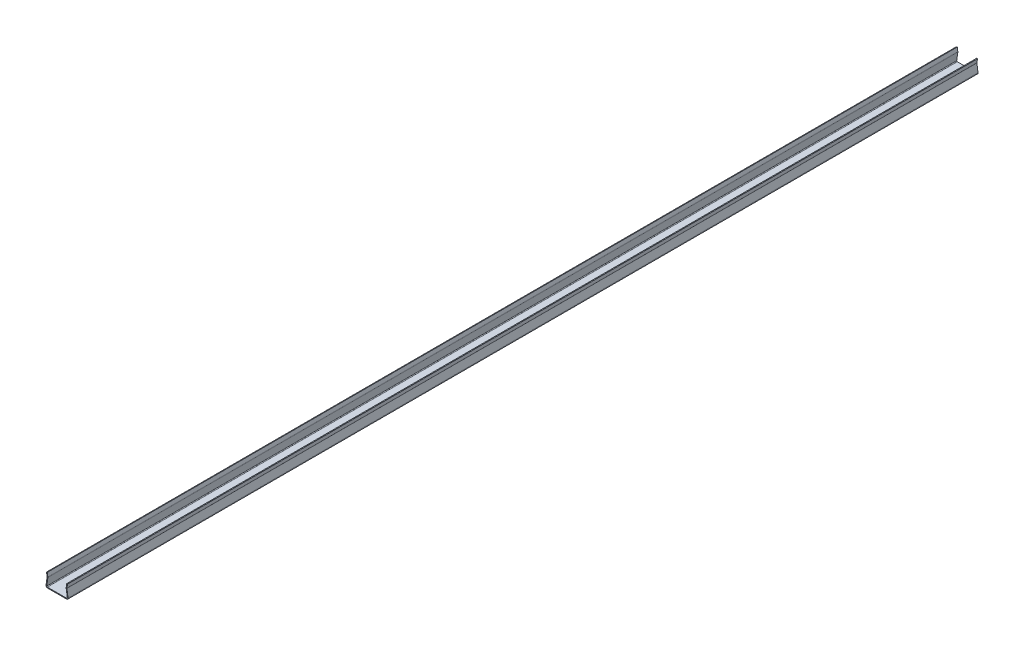
ISO-10303-21;
HEADER;
FILE_DESCRIPTION(('STEP AP214'),'2;1');
FILE_NAME('part.step','',(''),(''),'','','');
FILE_SCHEMA(('AUTOMOTIVE_DESIGN { 1 0 10303 214 1 1 1 1 }'));
ENDSEC;
DATA;
#1=APPLICATION_CONTEXT('core data for automotive mechanical design processes');
#2=APPLICATION_PROTOCOL_DEFINITION('international standard','automotive_design',2000,#1);
#3=PRODUCT_CONTEXT('',#1,'mechanical');
#4=PRODUCT('Part','Part','',(#3));
#5=PRODUCT_RELATED_PRODUCT_CATEGORY('part','',(#4));
#6=PRODUCT_DEFINITION_FORMATION('','',#4);
#7=PRODUCT_DEFINITION_CONTEXT('part definition',#1,'design');
#8=PRODUCT_DEFINITION('design','',#6,#7);
#9=PRODUCT_DEFINITION_SHAPE('','',#8);
#10=(LENGTH_UNIT() NAMED_UNIT(*) SI_UNIT(.MILLI.,.METRE.));
#11=(NAMED_UNIT(*) PLANE_ANGLE_UNIT() SI_UNIT($,.RADIAN.));
#12=(NAMED_UNIT(*) SI_UNIT($,.STERADIAN.) SOLID_ANGLE_UNIT());
#13=UNCERTAINTY_MEASURE_WITH_UNIT(LENGTH_MEASURE(1.E-05),#10,'distance_accuracy_value','');
#14=(GEOMETRIC_REPRESENTATION_CONTEXT(3) GLOBAL_UNCERTAINTY_ASSIGNED_CONTEXT((#13)) GLOBAL_UNIT_ASSIGNED_CONTEXT((#10,
#11,#12)) REPRESENTATION_CONTEXT('',''));
#15=CARTESIAN_POINT('',(0.,0.,0.));
#16=DIRECTION('',(0.,0.,1.));
#17=DIRECTION('',(1.,0.,0.));
#18=AXIS2_PLACEMENT_3D('',#15,#16,#17);
#19=CARTESIAN_POINT('',(-15.0458449843556,14.1676238634243,749.));
#20=DIRECTION('',(0.,0.,1.));
#21=DIRECTION('',(1.,0.,0.));
#22=AXIS2_PLACEMENT_3D('',#19,#20,#21);
#23=PLANE('',#22);
#24=DIRECTION('',(-0.990621129243475,0.136637397137033,0.));
#25=VECTOR('',#24,1.);
#26=CARTESIAN_POINT('',(-15.0458449843556,14.1676238634243,749.));
#27=LINE('',#26,#25);
#28=CARTESIAN_POINT('',(-15.0458449843556,14.1676238634243,749.));
#29=VERTEX_POINT('',#28);
#30=CARTESIAN_POINT('',(-16.333652452372,14.3452524797023,749.));
#31=VERTEX_POINT('',#30);
#32=EDGE_CURVE('E11',#29,#31,#27,.T.);
#33=ORIENTED_EDGE('',*,*,#32,.F.);
#34=CARTESIAN_POINT('',(-17.3242735816156,14.4818898768388,749.));
#35=DIRECTION('',(0.,0.,1.));
#36=DIRECTION('',(1.,0.,0.));
#37=AXIS2_PLACEMENT_3D('',#34,#35,#36);
#38=CIRCLE('',#37,2.3);
#39=CARTESIAN_POINT('',(-15.0510186770191,14.8316214006232,749.));
#40=VERTEX_POINT('',#39);
#41=EDGE_CURVE('E345',#40,#29,#38,.F.);
#42=ORIENTED_EDGE('',*,*,#41,.F.);
#43=DIRECTION('',(0.988371697650617,0.152057184253942,0.));
#44=VECTOR('',#43,1.);
#45=CARTESIAN_POINT('',(-16.3359018839648,14.6339470610934,749.));
#46=LINE('',#45,#44);
#47=CARTESIAN_POINT('',(-16.3359018839648,14.6339470610934,749.));
#48=VERTEX_POINT('',#47);
#49=EDGE_CURVE('E24',#48,#40,#46,.T.);
#50=ORIENTED_EDGE('',*,*,#49,.F.);
#51=CARTESIAN_POINT('',(-17.3242735816156,14.4818898768388,749.));
#52=DIRECTION('',(0.,0.,1.));
#53=DIRECTION('',(1.,0.,0.));
#54=AXIS2_PLACEMENT_3D('',#51,#52,#53);
#55=CIRCLE('',#54,1.);
#56=EDGE_CURVE('E358',#48,#31,#55,.F.);
#57=ORIENTED_EDGE('',*,*,#56,.T.);
#58=EDGE_LOOP('',(#33,#42,#50,#57));
#59=FACE_BOUND('',#58,.T.);
#60=ADVANCED_FACE('F16',(#59),#23,.T.);
#61=CARTESIAN_POINT('',(-16.3359018839648,14.6339470610934,749.));
#62=DIRECTION('',(0.,0.,1.));
#63=DIRECTION('',(1.,0.,0.));
#64=AXIS2_PLACEMENT_3D('',#61,#62,#63);
#65=PLANE('',#64);
#66=DIRECTION('',(-0.136637397137031,-0.990621129243475,0.));
#67=VECTOR('',#66,1.);
#68=CARTESIAN_POINT('',(-17.,0.,749.));
#69=LINE('',#68,#67);
#70=CARTESIAN_POINT('',(-16.8432224279814,1.13663739713754,749.));
#71=VERTEX_POINT('',#70);
#72=EDGE_CURVE('E349',#29,#71,#69,.T.);
#73=ORIENTED_EDGE('',*,*,#72,.F.);
#74=ORIENTED_EDGE('',*,*,#32,.T.);
#75=DIRECTION('',(-0.136637397137031,-0.990621129243475,0.));
#76=VECTOR('',#75,1.);
#77=CARTESIAN_POINT('',(-18.2878074680168,0.177628616278236,749.));
#78=LINE('',#77,#76);
#79=CARTESIAN_POINT('',(-18.1310298959977,1.314266013416,749.));
#80=VERTEX_POINT('',#79);
#81=EDGE_CURVE('E360',#31,#80,#78,.T.);
#82=ORIENTED_EDGE('',*,*,#81,.T.);
#83=DIRECTION('',(0.990621129243475,-0.136637397137031,0.));
#84=VECTOR('',#83,1.);
#85=CARTESIAN_POINT('',(-18.1310298959977,1.314266013416,749.));
#86=LINE('',#85,#84);
#87=EDGE_CURVE('E319',#80,#71,#86,.T.);
#88=ORIENTED_EDGE('',*,*,#87,.T.);
#89=EDGE_LOOP('',(#73,#74,#82,#88));
#90=FACE_BOUND('',#89,.T.);
#91=ADVANCED_FACE('F429',(#90),#65,.T.);
#92=CARTESIAN_POINT('',(-15.051018677019,14.8316214006232,-749.));
#93=DIRECTION('',(0.,0.,-1.));
#94=DIRECTION('',(-1.,0.,0.));
#95=AXIS2_PLACEMENT_3D('',#92,#93,#94);
#96=PLANE('',#95);
#97=DIRECTION('',(-0.988371697650617,-0.152057184253942,0.));
#98=VECTOR('',#97,1.);
#99=CARTESIAN_POINT('',(-15.051018677019,14.8316214006232,-749.));
#100=LINE('',#99,#98);
#101=CARTESIAN_POINT('',(-15.051018677019,14.8316214006232,-749.));
#102=VERTEX_POINT('',#101);
#103=CARTESIAN_POINT('',(-16.3359018839649,14.6339470610937,-749.));
#104=VERTEX_POINT('',#103);
#105=EDGE_CURVE('E325',#102,#104,#100,.T.);
#106=ORIENTED_EDGE('',*,*,#105,.F.);
#107=CARTESIAN_POINT('',(-17.3242735816156,14.4818898768391,-749.));
#108=DIRECTION('',(0.,0.,1.));
#109=DIRECTION('',(1.,0.,0.));
#110=AXIS2_PLACEMENT_3D('',#107,#108,#109);
#111=CIRCLE('',#110,2.3);
#112=CARTESIAN_POINT('',(-15.0458449843554,14.1676238634238,-749.));
#113=VERTEX_POINT('',#112);
#114=EDGE_CURVE('E229',#102,#113,#111,.F.);
#115=ORIENTED_EDGE('',*,*,#114,.T.);
#116=DIRECTION('',(0.990621129243475,-0.136637397137033,0.));
#117=VECTOR('',#116,1.);
#118=CARTESIAN_POINT('',(-16.333652452372,14.3452524797019,-749.));
#119=LINE('',#118,#117);
#120=CARTESIAN_POINT('',(-16.333652452372,14.3452524797019,-749.));
#121=VERTEX_POINT('',#120);
#122=EDGE_CURVE('E323',#121,#113,#119,.T.);
#123=ORIENTED_EDGE('',*,*,#122,.F.);
#124=CARTESIAN_POINT('',(-17.3242735816156,14.4818898768391,-749.));
#125=DIRECTION('',(0.,0.,1.));
#126=DIRECTION('',(1.,0.,0.));
#127=AXIS2_PLACEMENT_3D('',#124,#125,#126);
#128=CIRCLE('',#127,1.);
#129=EDGE_CURVE('E241',#104,#121,#128,.F.);
#130=ORIENTED_EDGE('',*,*,#129,.F.);
#131=EDGE_LOOP('',(#106,#115,#123,#130));
#132=FACE_BOUND('',#131,.T.);
#133=ADVANCED_FACE('F474',(#132),#96,.T.);
#134=CARTESIAN_POINT('',(-16.333652452372,14.3452524797019,-749.));
#135=DIRECTION('',(0.,0.,-1.));
#136=DIRECTION('',(-1.,0.,0.));
#137=AXIS2_PLACEMENT_3D('',#134,#135,#136);
#138=PLANE('',#137);
#139=DIRECTION('',(0.152057184253941,-0.988371697650617,0.));
#140=VECTOR('',#139,1.);
#141=CARTESIAN_POINT('',(-15.0000000000002,14.5,-749.));
#142=LINE('',#141,#140);
#143=CARTESIAN_POINT('',(-16.,21.0000000000004,-749.));
#144=VERTEX_POINT('',#143);
#145=EDGE_CURVE('E232',#144,#102,#142,.T.);
#146=ORIENTED_EDGE('',*,*,#145,.T.);
#147=ORIENTED_EDGE('',*,*,#105,.T.);
#148=DIRECTION('',(0.152057184253941,-0.988371697650617,0.));
#149=VECTOR('',#148,1.);
#150=CARTESIAN_POINT('',(-16.2848832069458,14.30232566047,-749.));
#151=LINE('',#150,#149);
#152=CARTESIAN_POINT('',(-17.2848832069461,20.8023256604699,-749.));
#153=VERTEX_POINT('',#152);
#154=EDGE_CURVE('E238',#153,#104,#151,.T.);
#155=ORIENTED_EDGE('',*,*,#154,.F.);
#156=DIRECTION('',(0.988371697650617,0.152057184253942,0.));
#157=VECTOR('',#156,1.);
#158=CARTESIAN_POINT('',(-17.2848832069461,20.8023256604699,-749.));
#159=LINE('',#158,#157);
#160=EDGE_CURVE('E235',#153,#144,#159,.T.);
#161=ORIENTED_EDGE('',*,*,#160,.T.);
#162=EDGE_LOOP('',(#146,#147,#155,#161));
#163=FACE_BOUND('',#162,.T.);
#164=ADVANCED_FACE('F479',(#163),#138,.T.);
#165=CARTESIAN_POINT('',(-15.8526012987378,8.88178419700125E-13,749.));
#166=DIRECTION('',(0.,0.,1.));
#167=DIRECTION('',(1.,0.,0.));
#168=AXIS2_PLACEMENT_3D('',#165,#166,#167);
#169=PLANE('',#168);
#170=DIRECTION('',(0.,-1.,0.));
#171=VECTOR('',#170,1.);
#172=CARTESIAN_POINT('',(-15.8526012987378,8.88178419700125E-13,749.));
#173=LINE('',#172,#171);
#174=CARTESIAN_POINT('',(-15.8526012987378,8.88178419700125E-13,749.));
#175=VERTEX_POINT('',#174);
#176=CARTESIAN_POINT('',(-15.8526012987378,-1.29999999999919,749.));
#177=VERTEX_POINT('',#176);
#178=EDGE_CURVE('E321',#175,#177,#173,.T.);
#179=ORIENTED_EDGE('',*,*,#178,.F.);
#180=CARTESIAN_POINT('',(-15.8526012987377,0.99999999999989,749.));
#181=DIRECTION('',(0.,0.,-1.));
#182=DIRECTION('',(-1.,0.,0.));
#183=AXIS2_PLACEMENT_3D('',#180,#181,#182);
#184=CIRCLE('',#183,1.);
#185=EDGE_CURVE('E419',#71,#175,#184,.F.);
#186=ORIENTED_EDGE('',*,*,#185,.F.);
#187=ORIENTED_EDGE('',*,*,#87,.F.);
#188=CARTESIAN_POINT('',(-15.8526012987377,0.99999999999989,749.));
#189=DIRECTION('',(0.,0.,1.));
#190=DIRECTION('',(1.,0.,0.));
#191=AXIS2_PLACEMENT_3D('',#188,#189,#190);
#192=CIRCLE('',#191,2.3);
#193=EDGE_CURVE('E363',#80,#177,#192,.T.);
#194=ORIENTED_EDGE('',*,*,#193,.T.);
#195=EDGE_LOOP('',(#179,#186,#187,#194));
#196=FACE_BOUND('',#195,.T.);
#197=ADVANCED_FACE('F436',(#196),#169,.T.);
#198=CARTESIAN_POINT('',(-18.1310298959977,1.314266013416,749.));
#199=DIRECTION('',(0.,0.,1.));
#200=DIRECTION('',(1.,0.,0.));
#201=AXIS2_PLACEMENT_3D('',#198,#199,#200);
#202=PLANE('',#201);
#203=DIRECTION('',(1.,0.,0.));
#204=VECTOR('',#203,1.);
#205=CARTESIAN_POINT('',(-17.,0.,749.));
#206=LINE('',#205,#204);
#207=CARTESIAN_POINT('',(15.8526012987377,0.,749.));
#208=VERTEX_POINT('',#207);
#209=EDGE_CURVE('E416',#175,#208,#206,.T.);
#210=ORIENTED_EDGE('',*,*,#209,.F.);
#211=ORIENTED_EDGE('',*,*,#178,.T.);
#212=DIRECTION('',(1.,0.,0.));
#213=VECTOR('',#212,1.);
#214=CARTESIAN_POINT('',(-17.,-1.29999999999919,749.));
#215=LINE('',#214,#213);
#216=CARTESIAN_POINT('',(15.8526012987376,-1.29999999999986,749.));
#217=VERTEX_POINT('',#216);
#218=EDGE_CURVE('E183',#177,#217,#215,.T.);
#219=ORIENTED_EDGE('',*,*,#218,.T.);
#220=DIRECTION('',(0.,1.,0.));
#221=VECTOR('',#220,1.);
#222=CARTESIAN_POINT('',(15.8526012987376,-1.29999999999986,749.));
#223=LINE('',#222,#221);
#224=EDGE_CURVE('E174',#217,#208,#223,.T.);
#225=ORIENTED_EDGE('',*,*,#224,.T.);
#226=EDGE_LOOP('',(#210,#211,#219,#225));
#227=FACE_BOUND('',#226,.T.);
#228=ADVANCED_FACE('F369',(#227),#202,.T.);
#229=CARTESIAN_POINT('',(-16.8432224279812,1.13663739713687,-749.));
#230=DIRECTION('',(0.,0.,-1.));
#231=DIRECTION('',(-1.,0.,0.));
#232=AXIS2_PLACEMENT_3D('',#229,#230,#231);
#233=PLANE('',#232);
#234=DIRECTION('',(-0.990621129243475,0.136637397137031,0.));
#235=VECTOR('',#234,1.);
#236=CARTESIAN_POINT('',(-16.8432224279812,1.13663739713687,-749.));
#237=LINE('',#236,#235);
#238=CARTESIAN_POINT('',(-16.8432224279812,1.13663739713687,-749.));
#239=VERTEX_POINT('',#238);
#240=CARTESIAN_POINT('',(-18.1310298959979,1.31426601341533,-749.));
#241=VERTEX_POINT('',#240);
#242=EDGE_CURVE('E317',#239,#241,#237,.T.);
#243=ORIENTED_EDGE('',*,*,#242,.F.);
#244=CARTESIAN_POINT('',(-15.8526012987377,1.00000000000011,-749.));
#245=DIRECTION('',(0.,0.,-1.));
#246=DIRECTION('',(-1.,0.,0.));
#247=AXIS2_PLACEMENT_3D('',#244,#245,#246);
#248=CIRCLE('',#247,1.);
#249=CARTESIAN_POINT('',(-15.8526012987376,4.44089209850063E-13,-749.));
#250=VERTEX_POINT('',#249);
#251=EDGE_CURVE('E223',#239,#250,#248,.F.);
#252=ORIENTED_EDGE('',*,*,#251,.T.);
#253=DIRECTION('',(0.,1.,0.));
#254=VECTOR('',#253,1.);
#255=CARTESIAN_POINT('',(-15.8526012987376,-1.29999999999919,-749.));
#256=LINE('',#255,#254);
#257=CARTESIAN_POINT('',(-15.8526012987376,-1.29999999999919,-749.));
#258=VERTEX_POINT('',#257);
#259=EDGE_CURVE('E173',#258,#250,#256,.T.);
#260=ORIENTED_EDGE('',*,*,#259,.F.);
#261=CARTESIAN_POINT('',(-15.8526012987377,1.00000000000011,-749.));
#262=DIRECTION('',(0.,0.,1.));
#263=DIRECTION('',(1.,0.,0.));
#264=AXIS2_PLACEMENT_3D('',#261,#262,#263);
#265=CIRCLE('',#264,2.3);
#266=EDGE_CURVE('E247',#241,#258,#265,.T.);
#267=ORIENTED_EDGE('',*,*,#266,.F.);
#268=EDGE_LOOP('',(#243,#252,#260,#267));
#269=FACE_BOUND('',#268,.T.);
#270=ADVANCED_FACE('F445',(#269),#233,.T.);
#271=CARTESIAN_POINT('',(-15.8526012987376,-1.29999999999919,-749.));
#272=DIRECTION('',(0.,0.,-1.));
#273=DIRECTION('',(-1.,0.,0.));
#274=AXIS2_PLACEMENT_3D('',#271,#272,#273);
#275=PLANE('',#274);
#276=DIRECTION('',(-0.136637397137031,-0.990621129243475,0.));
#277=VECTOR('',#276,1.);
#278=CARTESIAN_POINT('',(-17.,8.88178419700125E-13,-749.));
#279=LINE('',#278,#277);
#280=EDGE_CURVE('E226',#113,#239,#279,.T.);
#281=ORIENTED_EDGE('',*,*,#280,.T.);
#282=ORIENTED_EDGE('',*,*,#242,.T.);
#283=DIRECTION('',(-0.136637397137031,-0.990621129243475,0.));
#284=VECTOR('',#283,1.);
#285=CARTESIAN_POINT('',(-18.2878074680169,0.177628616278236,-749.));
#286=LINE('',#285,#284);
#287=EDGE_CURVE('E244',#121,#241,#286,.T.);
#288=ORIENTED_EDGE('',*,*,#287,.F.);
#289=ORIENTED_EDGE('',*,*,#122,.T.);
#290=EDGE_LOOP('',(#281,#282,#288,#289));
#291=FACE_BOUND('',#290,.T.);
#292=ADVANCED_FACE('F449',(#291),#275,.T.);
#293=CARTESIAN_POINT('',(16.8432224279812,1.13663739713776,749.));
#294=DIRECTION('',(0.,0.,1.));
#295=DIRECTION('',(1.,0.,0.));
#296=AXIS2_PLACEMENT_3D('',#293,#294,#295);
#297=PLANE('',#296);
#298=DIRECTION('',(0.990621129243475,0.136637397137031,0.));
#299=VECTOR('',#298,1.);
#300=CARTESIAN_POINT('',(16.8432224279812,1.13663739713776,749.));
#301=LINE('',#300,#299);
#302=CARTESIAN_POINT('',(16.8432224279812,1.13663739713776,749.));
#303=VERTEX_POINT('',#302);
#304=CARTESIAN_POINT('',(18.1310298959975,1.314266013416,749.));
#305=VERTEX_POINT('',#304);
#306=EDGE_CURVE('E161',#303,#305,#301,.T.);
#307=ORIENTED_EDGE('',*,*,#306,.F.);
#308=CARTESIAN_POINT('',(15.8526012987376,1.00000000000033,749.));
#309=DIRECTION('',(0.,0.,-1.));
#310=DIRECTION('',(-1.,0.,0.));
#311=AXIS2_PLACEMENT_3D('',#308,#309,#310);
#312=CIRCLE('',#311,1.);
#313=EDGE_CURVE('E381',#208,#303,#312,.F.);
#314=ORIENTED_EDGE('',*,*,#313,.F.);
#315=ORIENTED_EDGE('',*,*,#224,.F.);
#316=CARTESIAN_POINT('',(15.8526012987376,1.00000000000033,749.));
#317=DIRECTION('',(0.,0.,1.));
#318=DIRECTION('',(1.,0.,0.));
#319=AXIS2_PLACEMENT_3D('',#316,#317,#318);
#320=CIRCLE('',#319,2.3);
#321=EDGE_CURVE('E177',#217,#305,#320,.T.);
#322=ORIENTED_EDGE('',*,*,#321,.T.);
#323=EDGE_LOOP('',(#307,#314,#315,#322));
#324=FACE_BOUND('',#323,.T.);
#325=ADVANCED_FACE('F179',(#324),#297,.T.);
#326=CARTESIAN_POINT('',(15.8526012987376,-1.29999999999986,749.));
#327=DIRECTION('',(0.,0.,1.));
#328=DIRECTION('',(1.,0.,0.));
#329=AXIS2_PLACEMENT_3D('',#326,#327,#328);
#330=PLANE('',#329);
#331=DIRECTION('',(-0.136637397137031,0.990621129243475,0.));
#332=VECTOR('',#331,1.);
#333=CARTESIAN_POINT('',(17.,0.,749.));
#334=LINE('',#333,#332);
#335=CARTESIAN_POINT('',(15.0458449843551,14.1676238634243,749.));
#336=VERTEX_POINT('',#335);
#337=EDGE_CURVE('E168',#303,#336,#334,.T.);
#338=ORIENTED_EDGE('',*,*,#337,.F.);
#339=ORIENTED_EDGE('',*,*,#306,.T.);
#340=DIRECTION('',(-0.136637397137031,0.990621129243475,0.));
#341=VECTOR('',#340,1.);
#342=CARTESIAN_POINT('',(18.2878074680165,0.17762861627868,749.));
#343=LINE('',#342,#341);
#344=CARTESIAN_POINT('',(16.3336524523718,14.3452524797025,749.));
#345=VERTEX_POINT('',#344);
#346=EDGE_CURVE('E165',#305,#345,#343,.T.);
#347=ORIENTED_EDGE('',*,*,#346,.T.);
#348=DIRECTION('',(-0.990621129243474,-0.136637397137034,0.));
#349=VECTOR('',#348,1.);
#350=CARTESIAN_POINT('',(16.3336524523718,14.3452524797025,749.));
#351=LINE('',#350,#349);
#352=EDGE_CURVE('E308',#345,#336,#351,.T.);
#353=ORIENTED_EDGE('',*,*,#352,.T.);
#354=EDGE_LOOP('',(#338,#339,#347,#353));
#355=FACE_BOUND('',#354,.T.);
#356=ADVANCED_FACE('F163',(#355),#330,.T.);
#357=CARTESIAN_POINT('',(15.8526012987376,8.88178419700125E-13,-749.));
#358=DIRECTION('',(0.,0.,-1.));
#359=DIRECTION('',(-1.,0.,0.));
#360=AXIS2_PLACEMENT_3D('',#357,#358,#359);
#361=PLANE('',#360);
#362=DIRECTION('',(0.,-1.,0.));
#363=VECTOR('',#362,1.);
#364=CARTESIAN_POINT('',(15.8526012987376,8.88178419700125E-13,-749.));
#365=LINE('',#364,#363);
#366=CARTESIAN_POINT('',(15.8526012987376,8.88178419700125E-13,-749.));
#367=VERTEX_POINT('',#366);
#368=CARTESIAN_POINT('',(15.8526012987375,-1.29999999999986,-749.));
#369=VERTEX_POINT('',#368);
#370=EDGE_CURVE('E313',#367,#369,#365,.T.);
#371=ORIENTED_EDGE('',*,*,#370,.F.);
#372=CARTESIAN_POINT('',(15.8526012987375,1.00000000000078,-749.));
#373=DIRECTION('',(0.,0.,-1.));
#374=DIRECTION('',(-1.,0.,0.));
#375=AXIS2_PLACEMENT_3D('',#372,#373,#374);
#376=CIRCLE('',#375,1.);
#377=CARTESIAN_POINT('',(16.843222427981,1.1366373971371,-749.));
#378=VERTEX_POINT('',#377);
#379=EDGE_CURVE('E217',#367,#378,#376,.F.);
#380=ORIENTED_EDGE('',*,*,#379,.T.);
#381=DIRECTION('',(-0.990621129243475,-0.136637397137031,0.));
#382=VECTOR('',#381,1.);
#383=CARTESIAN_POINT('',(18.1310298959975,1.31426601341511,-749.));
#384=LINE('',#383,#382);
#385=CARTESIAN_POINT('',(18.1310298959975,1.31426601341511,-749.));
#386=VERTEX_POINT('',#385);
#387=EDGE_CURVE('E311',#386,#378,#384,.T.);
#388=ORIENTED_EDGE('',*,*,#387,.F.);
#389=CARTESIAN_POINT('',(15.8526012987375,1.00000000000078,-749.));
#390=DIRECTION('',(0.,0.,1.));
#391=DIRECTION('',(1.,0.,0.));
#392=AXIS2_PLACEMENT_3D('',#389,#390,#391);
#393=CIRCLE('',#392,2.3);
#394=EDGE_CURVE('E190',#369,#386,#393,.T.);
#395=ORIENTED_EDGE('',*,*,#394,.F.);
#396=EDGE_LOOP('',(#371,#380,#388,#395));
#397=FACE_BOUND('',#396,.T.);
#398=ADVANCED_FACE('F375',(#397),#361,.T.);
#399=CARTESIAN_POINT('',(18.1310298959975,1.31426601341511,-749.));
#400=DIRECTION('',(0.,0.,-1.));
#401=DIRECTION('',(-1.,0.,0.));
#402=AXIS2_PLACEMENT_3D('',#399,#400,#401);
#403=PLANE('',#402);
#404=DIRECTION('',(1.,0.,0.));
#405=VECTOR('',#404,1.);
#406=CARTESIAN_POINT('',(-17.,8.88178419700125E-13,-749.));
#407=LINE('',#406,#405);
#408=EDGE_CURVE('E220',#250,#367,#407,.T.);
#409=ORIENTED_EDGE('',*,*,#408,.T.);
#410=ORIENTED_EDGE('',*,*,#370,.T.);
#411=DIRECTION('',(1.,0.,0.));
#412=VECTOR('',#411,1.);
#413=CARTESIAN_POINT('',(-17.0000000000003,-1.29999999999986,-749.));
#414=LINE('',#413,#412);
#415=EDGE_CURVE('E250',#258,#369,#414,.T.);
#416=ORIENTED_EDGE('',*,*,#415,.F.);
#417=ORIENTED_EDGE('',*,*,#259,.T.);
#418=EDGE_LOOP('',(#409,#410,#416,#417));
#419=FACE_BOUND('',#418,.T.);
#420=ADVANCED_FACE('F455',(#419),#403,.T.);
#421=CARTESIAN_POINT('',(15.0510186770189,14.831621400623,749.));
#422=DIRECTION('',(0.,0.,1.));
#423=DIRECTION('',(1.,0.,0.));
#424=AXIS2_PLACEMENT_3D('',#421,#422,#423);
#425=PLANE('',#424);
#426=DIRECTION('',(0.988371697650617,-0.152057184253941,0.));
#427=VECTOR('',#426,1.);
#428=CARTESIAN_POINT('',(15.0510186770189,14.831621400623,749.));
#429=LINE('',#428,#427);
#430=CARTESIAN_POINT('',(15.0510186770189,14.831621400623,749.));
#431=VERTEX_POINT('',#430);
#432=CARTESIAN_POINT('',(16.3359018839647,14.6339470610928,749.));
#433=VERTEX_POINT('',#432);
#434=EDGE_CURVE('E32',#431,#433,#429,.T.);
#435=ORIENTED_EDGE('',*,*,#434,.F.);
#436=CARTESIAN_POINT('',(17.3242735816154,14.4818898768397,749.));
#437=DIRECTION('',(0.,0.,1.));
#438=DIRECTION('',(1.,0.,0.));
#439=AXIS2_PLACEMENT_3D('',#436,#437,#438);
#440=CIRCLE('',#439,2.3);
#441=EDGE_CURVE('E409',#336,#431,#440,.F.);
#442=ORIENTED_EDGE('',*,*,#441,.F.);
#443=ORIENTED_EDGE('',*,*,#352,.F.);
#444=CARTESIAN_POINT('',(17.3242735816154,14.4818898768397,749.));
#445=DIRECTION('',(0.,0.,1.));
#446=DIRECTION('',(1.,0.,0.));
#447=AXIS2_PLACEMENT_3D('',#444,#445,#446);
#448=CIRCLE('',#447,1.);
#449=EDGE_CURVE('E198',#345,#433,#448,.F.);
#450=ORIENTED_EDGE('',*,*,#449,.T.);
#451=EDGE_LOOP('',(#435,#442,#443,#450));
#452=FACE_BOUND('',#451,.T.);
#453=ADVANCED_FACE('F457',(#452),#425,.T.);
#454=CARTESIAN_POINT('',(16.3336524523718,14.3452524797025,749.));
#455=DIRECTION('',(0.,0.,1.));
#456=DIRECTION('',(1.,0.,0.));
#457=AXIS2_PLACEMENT_3D('',#454,#455,#456);
#458=PLANE('',#457);
#459=DIRECTION('',(0.152057184253941,0.988371697650618,0.));
#460=VECTOR('',#459,1.);
#461=CARTESIAN_POINT('',(15.,14.5000000000008,749.));
#462=LINE('',#461,#460);
#463=CARTESIAN_POINT('',(16.,21.,749.));
#464=VERTEX_POINT('',#463);
#465=EDGE_CURVE('E407',#431,#464,#462,.T.);
#466=ORIENTED_EDGE('',*,*,#465,.F.);
#467=ORIENTED_EDGE('',*,*,#434,.T.);
#468=DIRECTION('',(0.152057184253941,0.988371697650618,0.));
#469=VECTOR('',#468,1.);
#470=CARTESIAN_POINT('',(16.2848832069458,14.3023256604706,749.));
#471=LINE('',#470,#469);
#472=CARTESIAN_POINT('',(17.2848832069459,20.8023256604708,749.));
#473=VERTEX_POINT('',#472);
#474=EDGE_CURVE('E110',#433,#473,#471,.T.);
#475=ORIENTED_EDGE('',*,*,#474,.T.);
#476=DIRECTION('',(0.988371697650617,-0.152057184253942,0.));
#477=VECTOR('',#476,1.);
#478=CARTESIAN_POINT('',(16.,21.,749.));
#479=LINE('',#478,#477);
#480=EDGE_CURVE('E405',#464,#473,#479,.T.);
#481=ORIENTED_EDGE('',*,*,#480,.F.);
#482=EDGE_LOOP('',(#466,#467,#475,#481));
#483=FACE_BOUND('',#482,.T.);
#484=ADVANCED_FACE('F465',(#483),#458,.T.);
#485=CARTESIAN_POINT('',(15.0458449843552,14.1676238634236,-749.));
#486=DIRECTION('',(0.,0.,-1.));
#487=DIRECTION('',(-1.,0.,0.));
#488=AXIS2_PLACEMENT_3D('',#485,#486,#487);
#489=PLANE('',#488);
#490=DIRECTION('',(0.990621129243474,0.136637397137034,0.));
#491=VECTOR('',#490,1.);
#492=CARTESIAN_POINT('',(15.0458449843552,14.1676238634236,-749.));
#493=LINE('',#492,#491);
#494=CARTESIAN_POINT('',(15.0458449843552,14.1676238634236,-749.));
#495=VERTEX_POINT('',#494);
#496=CARTESIAN_POINT('',(16.3336524523716,14.3452524797019,-749.));
#497=VERTEX_POINT('',#496);
#498=EDGE_CURVE('E97',#495,#497,#493,.T.);
#499=ORIENTED_EDGE('',*,*,#498,.F.);
#500=CARTESIAN_POINT('',(17.3242735816151,14.4818898768388,-749.));
#501=DIRECTION('',(0.,0.,1.));
#502=DIRECTION('',(1.,0.,0.));
#503=AXIS2_PLACEMENT_3D('',#500,#501,#502);
#504=CIRCLE('',#503,2.3);
#505=CARTESIAN_POINT('',(15.0510186770189,14.8316214006234,-749.));
#506=VERTEX_POINT('',#505);
#507=EDGE_CURVE('E213',#495,#506,#504,.F.);
#508=ORIENTED_EDGE('',*,*,#507,.T.);
#509=DIRECTION('',(-0.988371697650617,0.152057184253941,0.));
#510=VECTOR('',#509,1.);
#511=CARTESIAN_POINT('',(16.3359018839644,14.633947061093,-749.));
#512=LINE('',#511,#510);
#513=CARTESIAN_POINT('',(16.3359018839644,14.633947061093,-749.));
#514=VERTEX_POINT('',#513);
#515=EDGE_CURVE('E104',#514,#506,#512,.T.);
#516=ORIENTED_EDGE('',*,*,#515,.F.);
#517=CARTESIAN_POINT('',(17.3242735816151,14.4818898768388,-749.));
#518=DIRECTION('',(0.,0.,1.));
#519=DIRECTION('',(1.,0.,0.));
#520=AXIS2_PLACEMENT_3D('',#517,#518,#519);
#521=CIRCLE('',#520,1.);
#522=EDGE_CURVE('E256',#497,#514,#521,.F.);
#523=ORIENTED_EDGE('',*,*,#522,.F.);
#524=EDGE_LOOP('',(#499,#508,#516,#523));
#525=FACE_BOUND('',#524,.T.);
#526=ADVANCED_FACE('F392',(#525),#489,.T.);
#527=CARTESIAN_POINT('',(16.3359018839644,14.633947061093,-749.));
#528=DIRECTION('',(0.,0.,-1.));
#529=DIRECTION('',(-1.,0.,0.));
#530=AXIS2_PLACEMENT_3D('',#527,#528,#529);
#531=PLANE('',#530);
#532=DIRECTION('',(-0.136637397137031,0.990621129243475,0.));
#533=VECTOR('',#532,1.);
#534=CARTESIAN_POINT('',(17.,2.22044604925032E-13,-749.));
#535=LINE('',#534,#533);
#536=EDGE_CURVE('E215',#378,#495,#535,.T.);
#537=ORIENTED_EDGE('',*,*,#536,.T.);
#538=ORIENTED_EDGE('',*,*,#498,.T.);
#539=DIRECTION('',(-0.136637397137031,0.990621129243475,0.));
#540=VECTOR('',#539,1.);
#541=CARTESIAN_POINT('',(18.2878074680164,0.177628616278236,-749.));
#542=LINE('',#541,#540);
#543=EDGE_CURVE('E254',#386,#497,#542,.T.);
#544=ORIENTED_EDGE('',*,*,#543,.F.);
#545=ORIENTED_EDGE('',*,*,#387,.T.);
#546=EDGE_LOOP('',(#537,#538,#544,#545));
#547=FACE_BOUND('',#546,.T.);
#548=ADVANCED_FACE('F377',(#547),#531,.T.);
#549=CARTESIAN_POINT('',(16.2848832069458,14.3023256604706,749.));
#550=DIRECTION('',(-0.988371697650617,0.152057184253941,0.));
#551=DIRECTION('',(-0.152057184253941,-0.988371697650618,0.));
#552=AXIS2_PLACEMENT_3D('',#549,#550,#551);
#553=PLANE('',#552);
#554=DIRECTION('',(0.152057184253941,0.988371697650618,0.));
#555=VECTOR('',#554,1.);
#556=CARTESIAN_POINT('',(16.2848832069457,14.30232566047,-749.));
#557=LINE('',#556,#555);
#558=CARTESIAN_POINT('',(17.284883206946,20.8023256604703,-749.));
#559=VERTEX_POINT('',#558);
#560=EDGE_CURVE('E204',#514,#559,#557,.T.);
#561=ORIENTED_EDGE('',*,*,#560,.T.);
#562=DIRECTION('',(0.,0.,-1.));
#563=VECTOR('',#562,1.);
#564=CARTESIAN_POINT('',(17.2848832069459,20.8023256604708,749.));
#565=LINE('',#564,#563);
#566=EDGE_CURVE('E304',#473,#559,#565,.T.);
#567=ORIENTED_EDGE('',*,*,#566,.F.);
#568=ORIENTED_EDGE('',*,*,#474,.F.);
#569=DIRECTION('',(0.,0.,-1.));
#570=VECTOR('',#569,1.);
#571=CARTESIAN_POINT('',(16.3359018839647,14.6339470610928,749.));
#572=LINE('',#571,#570);
#573=EDGE_CURVE('E200',#433,#514,#572,.T.);
#574=ORIENTED_EDGE('',*,*,#573,.T.);
#575=EDGE_LOOP('',(#561,#567,#568,#574));
#576=FACE_BOUND('',#575,.T.);
#577=ADVANCED_FACE('F398',(#576),#553,.F.);
#578=CARTESIAN_POINT('',(16.,21.,749.));
#579=DIRECTION('',(0.152057184253942,0.988371697650618,0.));
#580=DIRECTION('',(-0.988371697650617,0.152057184253942,0.));
#581=AXIS2_PLACEMENT_3D('',#578,#579,#580);
#582=PLANE('',#581);
#583=DIRECTION('',(0.988371697650617,-0.152057184253942,0.));
#584=VECTOR('',#583,1.);
#585=CARTESIAN_POINT('',(16.,21.,-749.));
#586=LINE('',#585,#584);
#587=CARTESIAN_POINT('',(16.,21.,-749.));
#588=VERTEX_POINT('',#587);
#589=EDGE_CURVE('E207',#588,#559,#586,.T.);
#590=ORIENTED_EDGE('',*,*,#589,.F.);
#591=DIRECTION('',(0.,0.,-1.));
#592=VECTOR('',#591,1.);
#593=CARTESIAN_POINT('',(16.,21.,749.));
#594=LINE('',#593,#592);
#595=EDGE_CURVE('E302',#464,#588,#594,.T.);
#596=ORIENTED_EDGE('',*,*,#595,.F.);
#597=ORIENTED_EDGE('',*,*,#480,.T.);
#598=ORIENTED_EDGE('',*,*,#566,.T.);
#599=EDGE_LOOP('',(#590,#596,#597,#598));
#600=FACE_BOUND('',#599,.T.);
#601=ADVANCED_FACE('F403',(#600),#582,.T.);
#602=CARTESIAN_POINT('',(15.,14.5000000000008,749.));
#603=DIRECTION('',(-0.988371697650617,0.152057184253941,0.));
#604=DIRECTION('',(-0.152057184253941,-0.988371697650618,0.));
#605=AXIS2_PLACEMENT_3D('',#602,#603,#604);
#606=PLANE('',#605);
#607=DIRECTION('',(0.152057184253941,0.988371697650618,0.));
#608=VECTOR('',#607,1.);
#609=CARTESIAN_POINT('',(14.9999999999998,14.5000000000002,-749.));
#610=LINE('',#609,#608);
#611=EDGE_CURVE('E210',#506,#588,#610,.T.);
#612=ORIENTED_EDGE('',*,*,#611,.F.);
#613=DIRECTION('',(0.,0.,-1.));
#614=VECTOR('',#613,1.);
#615=CARTESIAN_POINT('',(15.0510186770189,14.831621400623,749.));
#616=LINE('',#615,#614);
#617=EDGE_CURVE('E299',#431,#506,#616,.T.);
#618=ORIENTED_EDGE('',*,*,#617,.F.);
#619=ORIENTED_EDGE('',*,*,#465,.T.);
#620=ORIENTED_EDGE('',*,*,#595,.T.);
#621=EDGE_LOOP('',(#612,#618,#619,#620));
#622=FACE_BOUND('',#621,.T.);
#623=ADVANCED_FACE('F606',(#622),#606,.T.);
#624=CARTESIAN_POINT('',(17.3242735816154,14.4818898768397,749.));
#625=DIRECTION('',(0.,0.,-1.));
#626=DIRECTION('',(-1.,0.,0.));
#627=AXIS2_PLACEMENT_3D('',#624,#625,#626);
#628=CYLINDRICAL_SURFACE('',#627,2.3);
#629=ORIENTED_EDGE('',*,*,#507,.F.);
#630=DIRECTION('',(0.,0.,-1.));
#631=VECTOR('',#630,1.);
#632=CARTESIAN_POINT('',(15.0458449843551,14.1676238634243,749.));
#633=LINE('',#632,#631);
#634=EDGE_CURVE('E296',#336,#495,#633,.T.);
#635=ORIENTED_EDGE('',*,*,#634,.F.);
#636=ORIENTED_EDGE('',*,*,#441,.T.);
#637=ORIENTED_EDGE('',*,*,#617,.T.);
#638=EDGE_LOOP('',(#629,#635,#636,#637));
#639=FACE_BOUND('',#638,.T.);
#640=ADVANCED_FACE('F389',(#639),#628,.T.);
#641=CARTESIAN_POINT('',(17.,0.,749.));
#642=DIRECTION('',(-0.990621129243475,-0.136637397137031,0.));
#643=DIRECTION('',(0.136637397137031,-0.990621129243475,0.));
#644=AXIS2_PLACEMENT_3D('',#641,#642,#643);
#645=PLANE('',#644);
#646=ORIENTED_EDGE('',*,*,#536,.F.);
#647=DIRECTION('',(0.,0.,-1.));
#648=VECTOR('',#647,1.);
#649=CARTESIAN_POINT('',(16.8432224279812,1.13663739713776,749.));
#650=LINE('',#649,#648);
#651=EDGE_CURVE('E293',#303,#378,#650,.T.);
#652=ORIENTED_EDGE('',*,*,#651,.F.);
#653=ORIENTED_EDGE('',*,*,#337,.T.);
#654=ORIENTED_EDGE('',*,*,#634,.T.);
#655=EDGE_LOOP('',(#646,#652,#653,#654));
#656=FACE_BOUND('',#655,.T.);
#657=ADVANCED_FACE('F383',(#656),#645,.T.);
#658=CARTESIAN_POINT('',(15.8526012987376,1.00000000000033,749.));
#659=DIRECTION('',(0.,0.,-1.));
#660=DIRECTION('',(-1.,0.,0.));
#661=AXIS2_PLACEMENT_3D('',#658,#659,#660);
#662=CYLINDRICAL_SURFACE('',#661,1.);
#663=ORIENTED_EDGE('',*,*,#379,.F.);
#664=DIRECTION('',(0.,0.,-1.));
#665=VECTOR('',#664,1.);
#666=CARTESIAN_POINT('',(15.8526012987377,0.,749.));
#667=LINE('',#666,#665);
#668=EDGE_CURVE('E290',#208,#367,#667,.T.);
#669=ORIENTED_EDGE('',*,*,#668,.F.);
#670=ORIENTED_EDGE('',*,*,#313,.T.);
#671=ORIENTED_EDGE('',*,*,#651,.T.);
#672=EDGE_LOOP('',(#663,#669,#670,#671));
#673=FACE_BOUND('',#672,.T.);
#674=ADVANCED_FACE('F380',(#673),#662,.F.);
#675=CARTESIAN_POINT('',(-17.,0.,749.));
#676=DIRECTION('',(0.,1.,0.));
#677=DIRECTION('',(0.,0.,1.));
#678=AXIS2_PLACEMENT_3D('',#675,#676,#677);
#679=PLANE('',#678);
#680=ORIENTED_EDGE('',*,*,#408,.F.);
#681=DIRECTION('',(0.,0.,-1.));
#682=VECTOR('',#681,1.);
#683=CARTESIAN_POINT('',(-15.8526012987378,8.88178419700125E-13,749.));
#684=LINE('',#683,#682);
#685=EDGE_CURVE('E287',#175,#250,#684,.T.);
#686=ORIENTED_EDGE('',*,*,#685,.F.);
#687=ORIENTED_EDGE('',*,*,#209,.T.);
#688=ORIENTED_EDGE('',*,*,#668,.T.);
#689=EDGE_LOOP('',(#680,#686,#687,#688));
#690=FACE_BOUND('',#689,.T.);
#691=ADVANCED_FACE('F442',(#690),#679,.T.);
#692=CARTESIAN_POINT('',(-15.8526012987377,0.99999999999989,749.));
#693=DIRECTION('',(0.,0.,-1.));
#694=DIRECTION('',(-1.,0.,0.));
#695=AXIS2_PLACEMENT_3D('',#692,#693,#694);
#696=CYLINDRICAL_SURFACE('',#695,1.);
#697=ORIENTED_EDGE('',*,*,#251,.F.);
#698=DIRECTION('',(0.,0.,-1.));
#699=VECTOR('',#698,1.);
#700=CARTESIAN_POINT('',(-16.8432224279814,1.13663739713754,749.));
#701=LINE('',#700,#699);
#702=EDGE_CURVE('E284',#71,#239,#701,.T.);
#703=ORIENTED_EDGE('',*,*,#702,.F.);
#704=ORIENTED_EDGE('',*,*,#185,.T.);
#705=ORIENTED_EDGE('',*,*,#685,.T.);
#706=EDGE_LOOP('',(#697,#703,#704,#705));
#707=FACE_BOUND('',#706,.T.);
#708=ADVANCED_FACE('F435',(#707),#696,.F.);
#709=CARTESIAN_POINT('',(-17.,0.,749.));
#710=DIRECTION('',(0.990621129243475,-0.136637397137031,0.));
#711=DIRECTION('',(0.136637397137031,0.990621129243475,0.));
#712=AXIS2_PLACEMENT_3D('',#709,#710,#711);
#713=PLANE('',#712);
#714=ORIENTED_EDGE('',*,*,#280,.F.);
#715=DIRECTION('',(0.,0.,-1.));
#716=VECTOR('',#715,1.);
#717=CARTESIAN_POINT('',(-15.0458449843556,14.1676238634243,749.));
#718=LINE('',#717,#716);
#719=EDGE_CURVE('E281',#29,#113,#718,.T.);
#720=ORIENTED_EDGE('',*,*,#719,.F.);
#721=ORIENTED_EDGE('',*,*,#72,.T.);
#722=ORIENTED_EDGE('',*,*,#702,.T.);
#723=EDGE_LOOP('',(#714,#720,#721,#722));
#724=FACE_BOUND('',#723,.T.);
#725=ADVANCED_FACE('F425',(#724),#713,.T.);
#726=CARTESIAN_POINT('',(-17.3242735816156,14.4818898768388,749.));
#727=DIRECTION('',(0.,0.,-1.));
#728=DIRECTION('',(-1.,0.,0.));
#729=AXIS2_PLACEMENT_3D('',#726,#727,#728);
#730=CYLINDRICAL_SURFACE('',#729,2.3);
#731=ORIENTED_EDGE('',*,*,#114,.F.);
#732=DIRECTION('',(0.,0.,-1.));
#733=VECTOR('',#732,1.);
#734=CARTESIAN_POINT('',(-15.0510186770191,14.8316214006232,749.));
#735=LINE('',#734,#733);
#736=EDGE_CURVE('E278',#40,#102,#735,.T.);
#737=ORIENTED_EDGE('',*,*,#736,.F.);
#738=ORIENTED_EDGE('',*,*,#41,.T.);
#739=ORIENTED_EDGE('',*,*,#719,.T.);
#740=EDGE_LOOP('',(#731,#737,#738,#739));
#741=FACE_BOUND('',#740,.T.);
#742=ADVANCED_FACE('F344',(#741),#730,.T.);
#743=CARTESIAN_POINT('',(-15.,14.5000000000008,749.));
#744=DIRECTION('',(0.988371697650617,0.152057184253941,0.));
#745=DIRECTION('',(-0.152057184253941,0.988371697650617,0.));
#746=AXIS2_PLACEMENT_3D('',#743,#744,#745);
#747=PLANE('',#746);
#748=ORIENTED_EDGE('',*,*,#145,.F.);
#749=DIRECTION('',(0.,0.,-1.));
#750=VECTOR('',#749,1.);
#751=CARTESIAN_POINT('',(-16.0000000000003,21.,749.));
#752=LINE('',#751,#750);
#753=CARTESIAN_POINT('',(-16.0000000000003,21.,749.));
#754=VERTEX_POINT('',#753);
#755=EDGE_CURVE('E276',#754,#144,#752,.T.);
#756=ORIENTED_EDGE('',*,*,#755,.F.);
#757=DIRECTION('',(0.152057184253941,-0.988371697650617,0.));
#758=VECTOR('',#757,1.);
#759=CARTESIAN_POINT('',(-15.,14.5000000000008,749.));
#760=LINE('',#759,#758);
#761=EDGE_CURVE('E333',#754,#40,#760,.T.);
#762=ORIENTED_EDGE('',*,*,#761,.T.);
#763=ORIENTED_EDGE('',*,*,#736,.T.);
#764=EDGE_LOOP('',(#748,#756,#762,#763));
#765=FACE_BOUND('',#764,.T.);
#766=ADVANCED_FACE('F351',(#765),#747,.T.);
#767=CARTESIAN_POINT('',(-17.2848832069455,20.8023256604708,749.));
#768=DIRECTION('',(-0.152057184253942,0.988371697650617,0.));
#769=DIRECTION('',(-0.988371697650617,-0.152057184253942,0.));
#770=AXIS2_PLACEMENT_3D('',#767,#768,#769);
#771=PLANE('',#770);
#772=ORIENTED_EDGE('',*,*,#160,.F.);
#773=DIRECTION('',(0.,0.,-1.));
#774=VECTOR('',#773,1.);
#775=CARTESIAN_POINT('',(-17.2848832069455,20.8023256604708,749.));
#776=LINE('',#775,#774);
#777=CARTESIAN_POINT('',(-17.2848832069455,20.8023256604708,749.));
#778=VERTEX_POINT('',#777);
#779=EDGE_CURVE('E274',#778,#153,#776,.T.);
#780=ORIENTED_EDGE('',*,*,#779,.F.);
#781=DIRECTION('',(0.988371697650617,0.152057184253942,0.));
#782=VECTOR('',#781,1.);
#783=CARTESIAN_POINT('',(-17.2848832069455,20.8023256604708,749.));
#784=LINE('',#783,#782);
#785=EDGE_CURVE('E352',#778,#754,#784,.T.);
#786=ORIENTED_EDGE('',*,*,#785,.T.);
#787=ORIENTED_EDGE('',*,*,#755,.T.);
#788=EDGE_LOOP('',(#772,#780,#786,#787));
#789=FACE_BOUND('',#788,.T.);
#790=ADVANCED_FACE('F671',(#789),#771,.T.);
#791=CARTESIAN_POINT('',(-16.2848832069458,14.30232566047,749.));
#792=DIRECTION('',(0.988371697650617,0.152057184253941,0.));
#793=DIRECTION('',(-0.152057184253941,0.988371697650617,0.));
#794=AXIS2_PLACEMENT_3D('',#791,#792,#793);
#795=PLANE('',#794);
#796=ORIENTED_EDGE('',*,*,#154,.T.);
#797=DIRECTION('',(0.,0.,-1.));
#798=VECTOR('',#797,1.);
#799=CARTESIAN_POINT('',(-16.3359018839648,14.6339470610934,749.));
#800=LINE('',#799,#798);
#801=EDGE_CURVE('E271',#48,#104,#800,.T.);
#802=ORIENTED_EDGE('',*,*,#801,.F.);
#803=DIRECTION('',(0.152057184253941,-0.988371697650617,0.));
#804=VECTOR('',#803,1.);
#805=CARTESIAN_POINT('',(-16.2848832069458,14.30232566047,749.));
#806=LINE('',#805,#804);
#807=EDGE_CURVE('E336',#778,#48,#806,.T.);
#808=ORIENTED_EDGE('',*,*,#807,.F.);
#809=ORIENTED_EDGE('',*,*,#779,.T.);
#810=EDGE_LOOP('',(#796,#802,#808,#809));
#811=FACE_BOUND('',#810,.T.);
#812=ADVANCED_FACE('F679',(#811),#795,.F.);
#813=CARTESIAN_POINT('',(-17.3242735816156,14.4818898768388,749.));
#814=DIRECTION('',(0.,0.,-1.));
#815=DIRECTION('',(-1.,0.,0.));
#816=AXIS2_PLACEMENT_3D('',#813,#814,#815);
#817=CYLINDRICAL_SURFACE('',#816,1.);
#818=ORIENTED_EDGE('',*,*,#129,.T.);
#819=DIRECTION('',(0.,0.,-1.));
#820=VECTOR('',#819,1.);
#821=CARTESIAN_POINT('',(-16.333652452372,14.3452524797023,749.));
#822=LINE('',#821,#820);
#823=EDGE_CURVE('E268',#31,#121,#822,.T.);
#824=ORIENTED_EDGE('',*,*,#823,.F.);
#825=ORIENTED_EDGE('',*,*,#56,.F.);
#826=ORIENTED_EDGE('',*,*,#801,.T.);
#827=EDGE_LOOP('',(#818,#824,#825,#826));
#828=FACE_BOUND('',#827,.T.);
#829=ADVANCED_FACE('F688',(#828),#817,.F.);
#830=CARTESIAN_POINT('',(-18.2878074680168,0.177628616278236,749.));
#831=DIRECTION('',(0.990621129243475,-0.136637397137031,0.));
#832=DIRECTION('',(0.136637397137031,0.990621129243475,0.));
#833=AXIS2_PLACEMENT_3D('',#830,#831,#832);
#834=PLANE('',#833);
#835=ORIENTED_EDGE('',*,*,#287,.T.);
#836=DIRECTION('',(0.,0.,-1.));
#837=VECTOR('',#836,1.);
#838=CARTESIAN_POINT('',(-18.1310298959977,1.314266013416,749.));
#839=LINE('',#838,#837);
#840=EDGE_CURVE('E265',#80,#241,#839,.T.);
#841=ORIENTED_EDGE('',*,*,#840,.F.);
#842=ORIENTED_EDGE('',*,*,#81,.F.);
#843=ORIENTED_EDGE('',*,*,#823,.T.);
#844=EDGE_LOOP('',(#835,#841,#842,#843));
#845=FACE_BOUND('',#844,.T.);
#846=ADVANCED_FACE('F451',(#845),#834,.F.);
#847=CARTESIAN_POINT('',(-15.8526012987377,0.99999999999989,749.));
#848=DIRECTION('',(0.,0.,-1.));
#849=DIRECTION('',(-1.,0.,0.));
#850=AXIS2_PLACEMENT_3D('',#847,#848,#849);
#851=CYLINDRICAL_SURFACE('',#850,2.3);
#852=ORIENTED_EDGE('',*,*,#266,.T.);
#853=DIRECTION('',(0.,0.,-1.));
#854=VECTOR('',#853,1.);
#855=CARTESIAN_POINT('',(-15.8526012987378,-1.29999999999919,749.));
#856=LINE('',#855,#854);
#857=EDGE_CURVE('E262',#177,#258,#856,.T.);
#858=ORIENTED_EDGE('',*,*,#857,.F.);
#859=ORIENTED_EDGE('',*,*,#193,.F.);
#860=ORIENTED_EDGE('',*,*,#840,.T.);
#861=EDGE_LOOP('',(#852,#858,#859,#860));
#862=FACE_BOUND('',#861,.T.);
#863=ADVANCED_FACE('F454',(#862),#851,.T.);
#864=CARTESIAN_POINT('',(-17.,-1.29999999999919,749.));
#865=DIRECTION('',(0.,1.,0.));
#866=DIRECTION('',(0.,0.,1.));
#867=AXIS2_PLACEMENT_3D('',#864,#865,#866);
#868=PLANE('',#867);
#869=ORIENTED_EDGE('',*,*,#415,.T.);
#870=DIRECTION('',(0.,0.,-1.));
#871=VECTOR('',#870,1.);
#872=CARTESIAN_POINT('',(15.8526012987376,-1.29999999999986,749.));
#873=LINE('',#872,#871);
#874=EDGE_CURVE('E192',#217,#369,#873,.T.);
#875=ORIENTED_EDGE('',*,*,#874,.F.);
#876=ORIENTED_EDGE('',*,*,#218,.F.);
#877=ORIENTED_EDGE('',*,*,#857,.T.);
#878=EDGE_LOOP('',(#869,#875,#876,#877));
#879=FACE_BOUND('',#878,.T.);
#880=ADVANCED_FACE('F372',(#879),#868,.F.);
#881=CARTESIAN_POINT('',(15.8526012987376,1.00000000000033,749.));
#882=DIRECTION('',(0.,0.,-1.));
#883=DIRECTION('',(-1.,0.,0.));
#884=AXIS2_PLACEMENT_3D('',#881,#882,#883);
#885=CYLINDRICAL_SURFACE('',#884,2.3);
#886=ORIENTED_EDGE('',*,*,#394,.T.);
#887=DIRECTION('',(0.,0.,-1.));
#888=VECTOR('',#887,1.);
#889=CARTESIAN_POINT('',(18.1310298959975,1.314266013416,749.));
#890=LINE('',#889,#888);
#891=EDGE_CURVE('E187',#305,#386,#890,.T.);
#892=ORIENTED_EDGE('',*,*,#891,.F.);
#893=ORIENTED_EDGE('',*,*,#321,.F.);
#894=ORIENTED_EDGE('',*,*,#874,.T.);
#895=EDGE_LOOP('',(#886,#892,#893,#894));
#896=FACE_BOUND('',#895,.T.);
#897=ADVANCED_FACE('F188',(#896),#885,.T.);
#898=CARTESIAN_POINT('',(18.2878074680165,0.17762861627868,749.));
#899=DIRECTION('',(-0.990621129243475,-0.136637397137031,0.));
#900=DIRECTION('',(0.136637397137031,-0.990621129243475,0.));
#901=AXIS2_PLACEMENT_3D('',#898,#899,#900);
#902=PLANE('',#901);
#903=ORIENTED_EDGE('',*,*,#543,.T.);
#904=DIRECTION('',(0.,0.,-1.));
#905=VECTOR('',#904,1.);
#906=CARTESIAN_POINT('',(16.3336524523718,14.3452524797025,749.));
#907=LINE('',#906,#905);
#908=EDGE_CURVE('E193',#345,#497,#907,.T.);
#909=ORIENTED_EDGE('',*,*,#908,.F.);
#910=ORIENTED_EDGE('',*,*,#346,.F.);
#911=ORIENTED_EDGE('',*,*,#891,.T.);
#912=EDGE_LOOP('',(#903,#909,#910,#911));
#913=FACE_BOUND('',#912,.T.);
#914=ADVANCED_FACE('F195',(#913),#902,.F.);
#915=CARTESIAN_POINT('',(17.3242735816154,14.4818898768397,749.));
#916=DIRECTION('',(0.,0.,-1.));
#917=DIRECTION('',(-1.,0.,0.));
#918=AXIS2_PLACEMENT_3D('',#915,#916,#917);
#919=CYLINDRICAL_SURFACE('',#918,1.);
#920=ORIENTED_EDGE('',*,*,#522,.T.);
#921=ORIENTED_EDGE('',*,*,#573,.F.);
#922=ORIENTED_EDGE('',*,*,#449,.F.);
#923=ORIENTED_EDGE('',*,*,#908,.T.);
#924=EDGE_LOOP('',(#920,#921,#922,#923));
#925=FACE_BOUND('',#924,.T.);
#926=ADVANCED_FACE('F395',(#925),#919,.F.);
#927=CARTESIAN_POINT('',(17.3242735816154,14.4818898768397,749.));
#928=DIRECTION('',(0.,0.,1.));
#929=DIRECTION('',(1.,0.,0.));
#930=AXIS2_PLACEMENT_3D('',#927,#928,#929);
#931=PLANE('',#930);
#932=ORIENTED_EDGE('',*,*,#807,.T.);
#933=ORIENTED_EDGE('',*,*,#49,.T.);
#934=ORIENTED_EDGE('',*,*,#761,.F.);
#935=ORIENTED_EDGE('',*,*,#785,.F.);
#936=EDGE_LOOP('',(#932,#933,#934,#935));
#937=FACE_BOUND('',#936,.T.);
#938=ADVANCED_FACE('F330',(#937),#931,.T.);
#939=CARTESIAN_POINT('',(17.3242735816151,14.4818898768388,-749.));
#940=DIRECTION('',(0.,0.,1.));
#941=DIRECTION('',(1.,0.,0.));
#942=AXIS2_PLACEMENT_3D('',#939,#940,#941);
#943=PLANE('',#942);
#944=ORIENTED_EDGE('',*,*,#560,.F.);
#945=ORIENTED_EDGE('',*,*,#515,.T.);
#946=ORIENTED_EDGE('',*,*,#611,.T.);
#947=ORIENTED_EDGE('',*,*,#589,.T.);
#948=EDGE_LOOP('',(#944,#945,#946,#947));
#949=FACE_BOUND('',#948,.T.);
#950=ADVANCED_FACE('F400',(#949),#943,.F.);
#951=CLOSED_SHELL('',(#60,#91,#133,#164,#197,#228,#270,#292,#325,#356,#398,#420,#453,#484,#526,
#548,#577,#601,#623,#640,#657,#674,#691,#708,#725,#742,#766,#790,#812,#829,#846,#863,#880,#897,
#914,#926,#938,#950));
#952=MANIFOLD_SOLID_BREP('B1',#951);
#953=ADVANCED_BREP_SHAPE_REPRESENTATION('',(#18,#952),#14);
#954=SHAPE_DEFINITION_REPRESENTATION(#9,#953);
ENDSEC;
END-ISO-10303-21;
